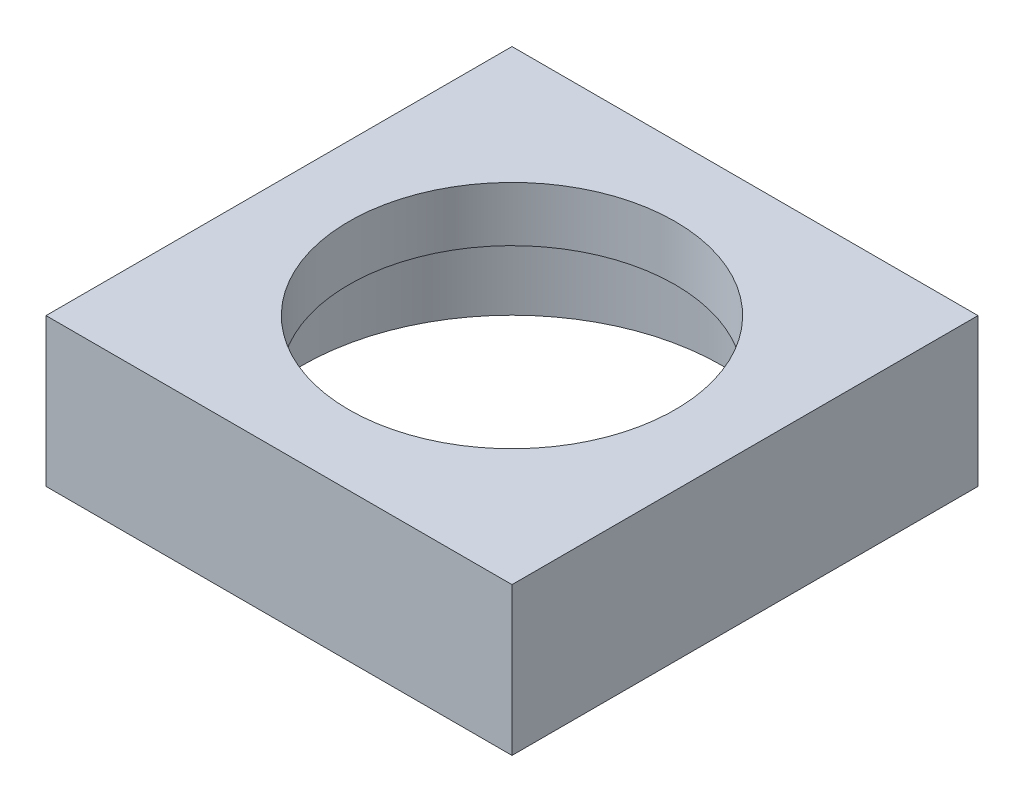
ISO-10303-21;
HEADER;
FILE_DESCRIPTION(('STEP AP214'),'2;1');
FILE_NAME('part.step','',(''),(''),'','','');
FILE_SCHEMA(('AUTOMOTIVE_DESIGN { 1 0 10303 214 1 1 1 1 }'));
ENDSEC;
DATA;
#1=APPLICATION_CONTEXT('core data for automotive mechanical design processes');
#2=APPLICATION_PROTOCOL_DEFINITION('international standard','automotive_design',2000,#1);
#3=PRODUCT_CONTEXT('',#1,'mechanical');
#4=PRODUCT('Part','Part','',(#3));
#5=PRODUCT_RELATED_PRODUCT_CATEGORY('part','',(#4));
#6=PRODUCT_DEFINITION_FORMATION('','',#4);
#7=PRODUCT_DEFINITION_CONTEXT('part definition',#1,'design');
#8=PRODUCT_DEFINITION('design','',#6,#7);
#9=PRODUCT_DEFINITION_SHAPE('','',#8);
#10=(LENGTH_UNIT() NAMED_UNIT(*) SI_UNIT(.MILLI.,.METRE.));
#11=(NAMED_UNIT(*) PLANE_ANGLE_UNIT() SI_UNIT($,.RADIAN.));
#12=(NAMED_UNIT(*) SI_UNIT($,.STERADIAN.) SOLID_ANGLE_UNIT());
#13=UNCERTAINTY_MEASURE_WITH_UNIT(LENGTH_MEASURE(1.E-05),#10,'distance_accuracy_value','');
#14=(GEOMETRIC_REPRESENTATION_CONTEXT(3) GLOBAL_UNCERTAINTY_ASSIGNED_CONTEXT((#13)) GLOBAL_UNIT_ASSIGNED_CONTEXT((#10,
#11,#12)) REPRESENTATION_CONTEXT('',''));
#15=CARTESIAN_POINT('',(0.,0.,0.));
#16=DIRECTION('',(0.,0.,1.));
#17=DIRECTION('',(1.,0.,0.));
#18=AXIS2_PLACEMENT_3D('',#15,#16,#17);
#19=CARTESIAN_POINT('',(5.,3.175,5.));
#20=DIRECTION('',(0.,-1.,0.));
#21=DIRECTION('',(0.,0.,-1.));
#22=AXIS2_PLACEMENT_3D('',#19,#20,#21);
#23=CYLINDRICAL_SURFACE('',#22,4.5);
#24=CARTESIAN_POINT('',(5.,0.,5.));
#25=DIRECTION('',(0.,1.,0.));
#26=DIRECTION('',(0.,0.,1.));
#27=AXIS2_PLACEMENT_3D('',#24,#25,#26);
#28=CIRCLE('',#27,4.5);
#29=CARTESIAN_POINT('',(5.,0.,9.5));
#30=VERTEX_POINT('',#29);
#31=EDGE_CURVE('E119',#30,#30,#28,.T.);
#32=ORIENTED_EDGE('',*,*,#31,.F.);
#33=EDGE_LOOP('',(#32));
#34=FACE_BOUND('',#33,.T.);
#35=CARTESIAN_POINT('',(5.,2.,5.));
#36=DIRECTION('',(0.,1.,0.));
#37=DIRECTION('',(0.,0.,1.));
#38=AXIS2_PLACEMENT_3D('',#35,#36,#37);
#39=CIRCLE('',#38,4.5);
#40=CARTESIAN_POINT('',(5.,2.,9.5));
#41=VERTEX_POINT('',#40);
#42=EDGE_CURVE('E49',#41,#41,#39,.T.);
#43=ORIENTED_EDGE('',*,*,#42,.T.);
#44=EDGE_LOOP('',(#43));
#45=FACE_BOUND('',#44,.T.);
#46=ADVANCED_FACE('F45',(#34,#45),#23,.F.);
#47=CARTESIAN_POINT('',(0.,3.175,0.));
#48=DIRECTION('',(0.,1.,0.));
#49=DIRECTION('',(0.,0.,1.));
#50=AXIS2_PLACEMENT_3D('',#47,#48,#49);
#51=PLANE('',#50);
#52=DIRECTION('',(0.,0.,1.));
#53=VECTOR('',#52,1.);
#54=CARTESIAN_POINT('',(0.,3.175,0.));
#55=LINE('',#54,#53);
#56=CARTESIAN_POINT('',(0.,3.175,0.));
#57=VERTEX_POINT('',#56);
#58=CARTESIAN_POINT('',(0.,3.175,10.));
#59=VERTEX_POINT('',#58);
#60=EDGE_CURVE('E97',#57,#59,#55,.T.);
#61=ORIENTED_EDGE('',*,*,#60,.T.);
#62=DIRECTION('',(1.,0.,0.));
#63=VECTOR('',#62,1.);
#64=CARTESIAN_POINT('',(0.,3.175,10.));
#65=LINE('',#64,#63);
#66=CARTESIAN_POINT('',(10.,3.175,10.));
#67=VERTEX_POINT('',#66);
#68=EDGE_CURVE('E92',#59,#67,#65,.T.);
#69=ORIENTED_EDGE('',*,*,#68,.T.);
#70=DIRECTION('',(0.,0.,-1.));
#71=VECTOR('',#70,1.);
#72=CARTESIAN_POINT('',(10.,3.175,0.));
#73=LINE('',#72,#71);
#74=CARTESIAN_POINT('',(10.,3.175,0.));
#75=VERTEX_POINT('',#74);
#76=EDGE_CURVE('E96',#67,#75,#73,.T.);
#77=ORIENTED_EDGE('',*,*,#76,.T.);
#78=DIRECTION('',(-1.,0.,0.));
#79=VECTOR('',#78,1.);
#80=CARTESIAN_POINT('',(0.,3.175,0.));
#81=LINE('',#80,#79);
#82=EDGE_CURVE('E64',#75,#57,#81,.T.);
#83=ORIENTED_EDGE('',*,*,#82,.T.);
#84=EDGE_LOOP('',(#61,#69,#77,#83));
#85=FACE_BOUND('',#84,.T.);
#86=CARTESIAN_POINT('',(5.,3.175,5.));
#87=DIRECTION('',(0.,1.,0.));
#88=DIRECTION('',(0.,0.,1.));
#89=AXIS2_PLACEMENT_3D('',#86,#87,#88);
#90=CIRCLE('',#89,3.5);
#91=CARTESIAN_POINT('',(5.,3.175,8.5));
#92=VERTEX_POINT('',#91);
#93=EDGE_CURVE('E138',#92,#92,#90,.T.);
#94=ORIENTED_EDGE('',*,*,#93,.F.);
#95=EDGE_LOOP('',(#94));
#96=FACE_BOUND('',#95,.T.);
#97=ADVANCED_FACE('F93',(#85,#96),#51,.T.);
#98=CARTESIAN_POINT('',(0.,0.,0.));
#99=DIRECTION('',(0.,1.,0.));
#100=DIRECTION('',(0.,0.,1.));
#101=AXIS2_PLACEMENT_3D('',#98,#99,#100);
#102=PLANE('',#101);
#103=DIRECTION('',(0.,0.,1.));
#104=VECTOR('',#103,1.);
#105=CARTESIAN_POINT('',(0.,0.,0.));
#106=LINE('',#105,#104);
#107=CARTESIAN_POINT('',(0.,0.,0.));
#108=VERTEX_POINT('',#107);
#109=CARTESIAN_POINT('',(0.,0.,10.));
#110=VERTEX_POINT('',#109);
#111=EDGE_CURVE('E116',#108,#110,#106,.T.);
#112=ORIENTED_EDGE('',*,*,#111,.F.);
#113=DIRECTION('',(-1.,0.,0.));
#114=VECTOR('',#113,1.);
#115=CARTESIAN_POINT('',(0.,0.,0.));
#116=LINE('',#115,#114);
#117=CARTESIAN_POINT('',(10.,0.,0.));
#118=VERTEX_POINT('',#117);
#119=EDGE_CURVE('E125',#118,#108,#116,.T.);
#120=ORIENTED_EDGE('',*,*,#119,.F.);
#121=DIRECTION('',(0.,0.,-1.));
#122=VECTOR('',#121,1.);
#123=CARTESIAN_POINT('',(10.,0.,0.));
#124=LINE('',#123,#122);
#125=CARTESIAN_POINT('',(10.,0.,10.));
#126=VERTEX_POINT('',#125);
#127=EDGE_CURVE('E122',#126,#118,#124,.T.);
#128=ORIENTED_EDGE('',*,*,#127,.F.);
#129=DIRECTION('',(1.,0.,0.));
#130=VECTOR('',#129,1.);
#131=CARTESIAN_POINT('',(0.,0.,10.));
#132=LINE('',#131,#130);
#133=EDGE_CURVE('E104',#110,#126,#132,.T.);
#134=ORIENTED_EDGE('',*,*,#133,.F.);
#135=EDGE_LOOP('',(#112,#120,#128,#134));
#136=FACE_BOUND('',#135,.T.);
#137=ORIENTED_EDGE('',*,*,#31,.T.);
#138=EDGE_LOOP('',(#137));
#139=FACE_BOUND('',#138,.T.);
#140=ADVANCED_FACE('F171',(#136,#139),#102,.F.);
#141=CARTESIAN_POINT('',(0.,3.175,0.));
#142=DIRECTION('',(1.,0.,0.));
#143=DIRECTION('',(0.,0.,-1.));
#144=AXIS2_PLACEMENT_3D('',#141,#142,#143);
#145=PLANE('',#144);
#146=DIRECTION('',(0.,-1.,0.));
#147=VECTOR('',#146,1.);
#148=CARTESIAN_POINT('',(0.,3.175,0.));
#149=LINE('',#148,#147);
#150=EDGE_CURVE('E86',#57,#108,#149,.T.);
#151=ORIENTED_EDGE('',*,*,#150,.T.);
#152=ORIENTED_EDGE('',*,*,#111,.T.);
#153=DIRECTION('',(0.,-1.,0.));
#154=VECTOR('',#153,1.);
#155=CARTESIAN_POINT('',(0.,3.175,10.));
#156=LINE('',#155,#154);
#157=EDGE_CURVE('E11',#59,#110,#156,.T.);
#158=ORIENTED_EDGE('',*,*,#157,.F.);
#159=ORIENTED_EDGE('',*,*,#60,.F.);
#160=EDGE_LOOP('',(#151,#152,#158,#159));
#161=FACE_BOUND('',#160,.T.);
#162=ADVANCED_FACE('F47',(#161),#145,.F.);
#163=CARTESIAN_POINT('',(0.,3.175,10.));
#164=DIRECTION('',(0.,0.,-1.));
#165=DIRECTION('',(-1.,0.,0.));
#166=AXIS2_PLACEMENT_3D('',#163,#164,#165);
#167=PLANE('',#166);
#168=ORIENTED_EDGE('',*,*,#157,.T.);
#169=ORIENTED_EDGE('',*,*,#133,.T.);
#170=DIRECTION('',(0.,-1.,0.));
#171=VECTOR('',#170,1.);
#172=CARTESIAN_POINT('',(10.,3.175,10.));
#173=LINE('',#172,#171);
#174=EDGE_CURVE('E56',#67,#126,#173,.T.);
#175=ORIENTED_EDGE('',*,*,#174,.F.);
#176=ORIENTED_EDGE('',*,*,#68,.F.);
#177=EDGE_LOOP('',(#168,#169,#175,#176));
#178=FACE_BOUND('',#177,.T.);
#179=ADVANCED_FACE('F102',(#178),#167,.F.);
#180=CARTESIAN_POINT('',(10.,3.175,0.));
#181=DIRECTION('',(-1.,0.,0.));
#182=DIRECTION('',(0.,0.,1.));
#183=AXIS2_PLACEMENT_3D('',#180,#181,#182);
#184=PLANE('',#183);
#185=ORIENTED_EDGE('',*,*,#174,.T.);
#186=ORIENTED_EDGE('',*,*,#127,.T.);
#187=DIRECTION('',(0.,-1.,0.));
#188=VECTOR('',#187,1.);
#189=CARTESIAN_POINT('',(10.,3.175,0.));
#190=LINE('',#189,#188);
#191=EDGE_CURVE('E79',#75,#118,#190,.T.);
#192=ORIENTED_EDGE('',*,*,#191,.F.);
#193=ORIENTED_EDGE('',*,*,#76,.F.);
#194=EDGE_LOOP('',(#185,#186,#192,#193));
#195=FACE_BOUND('',#194,.T.);
#196=ADVANCED_FACE('F109',(#195),#184,.F.);
#197=CARTESIAN_POINT('',(0.,3.175,0.));
#198=DIRECTION('',(0.,0.,1.));
#199=DIRECTION('',(1.,0.,0.));
#200=AXIS2_PLACEMENT_3D('',#197,#198,#199);
#201=PLANE('',#200);
#202=ORIENTED_EDGE('',*,*,#191,.T.);
#203=ORIENTED_EDGE('',*,*,#119,.T.);
#204=ORIENTED_EDGE('',*,*,#150,.F.);
#205=ORIENTED_EDGE('',*,*,#82,.F.);
#206=EDGE_LOOP('',(#202,#203,#204,#205));
#207=FACE_BOUND('',#206,.T.);
#208=ADVANCED_FACE('F155',(#207),#201,.F.);
#209=CARTESIAN_POINT('',(0.,2.,0.));
#210=DIRECTION('',(0.,1.,0.));
#211=DIRECTION('',(0.,0.,1.));
#212=AXIS2_PLACEMENT_3D('',#209,#210,#211);
#213=PLANE('',#212);
#214=CARTESIAN_POINT('',(5.,2.,5.));
#215=DIRECTION('',(0.,1.,0.));
#216=DIRECTION('',(0.,0.,1.));
#217=AXIS2_PLACEMENT_3D('',#214,#215,#216);
#218=CIRCLE('',#217,3.5);
#219=CARTESIAN_POINT('',(5.,2.,8.5));
#220=VERTEX_POINT('',#219);
#221=EDGE_CURVE('E142',#220,#220,#218,.T.);
#222=ORIENTED_EDGE('',*,*,#221,.T.);
#223=EDGE_LOOP('',(#222));
#224=FACE_BOUND('',#223,.T.);
#225=ORIENTED_EDGE('',*,*,#42,.F.);
#226=EDGE_LOOP('',(#225));
#227=FACE_BOUND('',#226,.T.);
#228=ADVANCED_FACE('F152',(#224,#227),#213,.F.);
#229=CARTESIAN_POINT('',(5.,2.,5.));
#230=DIRECTION('',(0.,1.,0.));
#231=DIRECTION('',(0.,0.,1.));
#232=AXIS2_PLACEMENT_3D('',#229,#230,#231);
#233=CYLINDRICAL_SURFACE('',#232,3.5);
#234=ORIENTED_EDGE('',*,*,#221,.F.);
#235=EDGE_LOOP('',(#234));
#236=FACE_BOUND('',#235,.T.);
#237=ORIENTED_EDGE('',*,*,#93,.T.);
#238=EDGE_LOOP('',(#237));
#239=FACE_BOUND('',#238,.T.);
#240=ADVANCED_FACE('F154',(#236,#239),#233,.F.);
#241=CLOSED_SHELL('',(#46,#97,#140,#162,#179,#196,#208,#228,#240));
#242=MANIFOLD_SOLID_BREP('B2',#241);
#243=ADVANCED_BREP_SHAPE_REPRESENTATION('',(#18,#242),#14);
#244=SHAPE_DEFINITION_REPRESENTATION(#9,#243);
ENDSEC;
END-ISO-10303-21;
